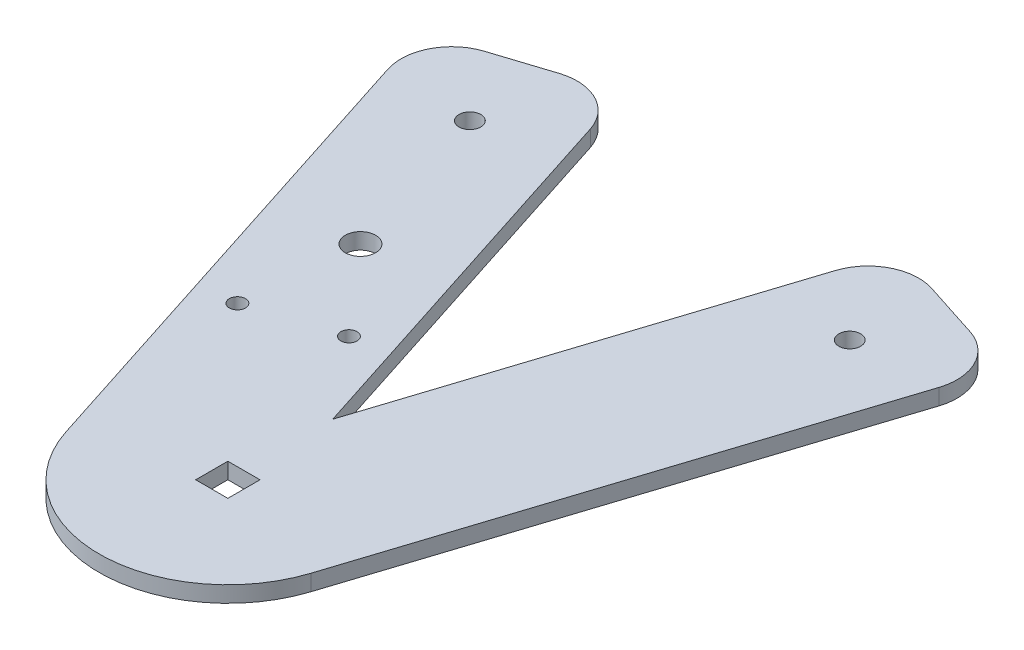
ISO-10303-21;
HEADER;
FILE_DESCRIPTION(('STEP AP214'),'2;1');
FILE_NAME('part.step','',(''),(''),'','','');
FILE_SCHEMA(('AUTOMOTIVE_DESIGN { 1 0 10303 214 1 1 1 1 }'));
ENDSEC;
DATA;
#1=APPLICATION_CONTEXT('core data for automotive mechanical design processes');
#2=APPLICATION_PROTOCOL_DEFINITION('international standard','automotive_design',2000,#1);
#3=PRODUCT_CONTEXT('',#1,'mechanical');
#4=PRODUCT('Part','Part','',(#3));
#5=PRODUCT_RELATED_PRODUCT_CATEGORY('part','',(#4));
#6=PRODUCT_DEFINITION_FORMATION('','',#4);
#7=PRODUCT_DEFINITION_CONTEXT('part definition',#1,'design');
#8=PRODUCT_DEFINITION('design','',#6,#7);
#9=PRODUCT_DEFINITION_SHAPE('','',#8);
#10=(LENGTH_UNIT() NAMED_UNIT(*) SI_UNIT(.MILLI.,.METRE.));
#11=(NAMED_UNIT(*) PLANE_ANGLE_UNIT() SI_UNIT($,.RADIAN.));
#12=(NAMED_UNIT(*) SI_UNIT($,.STERADIAN.) SOLID_ANGLE_UNIT());
#13=UNCERTAINTY_MEASURE_WITH_UNIT(LENGTH_MEASURE(1.E-05),#10,'distance_accuracy_value','');
#14=(GEOMETRIC_REPRESENTATION_CONTEXT(3) GLOBAL_UNCERTAINTY_ASSIGNED_CONTEXT((#13)) GLOBAL_UNIT_ASSIGNED_CONTEXT((#10,
#11,#12)) REPRESENTATION_CONTEXT('',''));
#15=CARTESIAN_POINT('',(0.,0.,0.));
#16=DIRECTION('',(0.,0.,1.));
#17=DIRECTION('',(1.,0.,0.));
#18=AXIS2_PLACEMENT_3D('',#15,#16,#17);
#19=CARTESIAN_POINT('',(0.,3.175,0.));
#20=DIRECTION('',(0.,-1.,0.));
#21=DIRECTION('',(0.,0.,-1.));
#22=AXIS2_PLACEMENT_3D('',#19,#20,#21);
#23=PLANE('',#22);
#24=CARTESIAN_POINT('',(-37.5,3.175,-85.2955486822144));
#25=DIRECTION('',(0.,1.,0.));
#26=DIRECTION('',(0.,0.,1.));
#27=AXIS2_PLACEMENT_3D('',#24,#25,#26);
#28=CIRCLE('',#27,2.15);
#29=CARTESIAN_POINT('',(-37.5,3.175,-83.1455486822144));
#30=VERTEX_POINT('',#29);
#31=EDGE_CURVE('E193',#30,#30,#28,.T.);
#32=ORIENTED_EDGE('',*,*,#31,.F.);
#33=EDGE_LOOP('',(#32));
#34=FACE_BOUND('',#33,.T.);
#35=CARTESIAN_POINT('',(37.5,3.175,-85.2955486822144));
#36=DIRECTION('',(0.,1.,0.));
#37=DIRECTION('',(0.,0.,1.));
#38=AXIS2_PLACEMENT_3D('',#35,#36,#37);
#39=CIRCLE('',#38,2.15);
#40=CARTESIAN_POINT('',(37.5,3.175,-83.1455486822144));
#41=VERTEX_POINT('',#40);
#42=EDGE_CURVE('E199',#41,#41,#39,.T.);
#43=ORIENTED_EDGE('',*,*,#42,.F.);
#44=EDGE_LOOP('',(#43));
#45=FACE_BOUND('',#44,.T.);
#46=DIRECTION('',(0.306777931665619,0.,-0.951781120133702));
#47=VECTOR('',#46,1.);
#48=CARTESIAN_POINT('',(24.175240451396,3.175,7.79215946430672));
#49=LINE('',#48,#47);
#50=CARTESIAN_POINT('',(24.175240451396,3.175,7.79215946430672));
#51=VERTEX_POINT('',#50);
#52=CARTESIAN_POINT('',(54.411845630658,3.175,-86.0171630978082));
#53=VERTEX_POINT('',#52);
#54=EDGE_CURVE('E213',#51,#53,#49,.T.);
#55=ORIENTED_EDGE('',*,*,#54,.T.);
#56=CARTESIAN_POINT('',(44.894034429321,3.175,-89.0849424144644));
#57=DIRECTION('',(0.,-1.,0.));
#58=DIRECTION('',(0.,0.,-1.));
#59=AXIS2_PLACEMENT_3D('',#56,#57,#58);
#60=CIRCLE('',#59,10.);
#61=CARTESIAN_POINT('',(47.9618137459772,3.175,-98.6027536158014));
#62=VERTEX_POINT('',#61);
#63=EDGE_CURVE('E266',#53,#62,#60,.F.);
#64=ORIENTED_EDGE('',*,*,#63,.T.);
#65=DIRECTION('',(-0.951781120133702,0.,-0.306777931665619));
#66=VECTOR('',#65,1.);
#67=CARTESIAN_POINT('',(27.2605743830692,3.175,-105.275173629529));
#68=LINE('',#67,#66);
#69=CARTESIAN_POINT('',(36.7783855844062,3.175,-102.207394312872));
#70=VERTEX_POINT('',#69);
#71=EDGE_CURVE('E216',#62,#70,#68,.T.);
#72=ORIENTED_EDGE('',*,*,#71,.T.);
#73=CARTESIAN_POINT('',(33.71060626775,3.175,-92.6895831115354));
#74=DIRECTION('',(0.,-1.,0.));
#75=DIRECTION('',(0.,0.,-1.));
#76=AXIS2_PLACEMENT_3D('',#73,#74,#75);
#77=CIRCLE('',#76,10.);
#78=CARTESIAN_POINT('',(24.192795066413,3.175,-95.7573624281916));
#79=VERTEX_POINT('',#78);
#80=EDGE_CURVE('E61',#70,#79,#77,.F.);
#81=ORIENTED_EDGE('',*,*,#80,.T.);
#82=DIRECTION('',(-0.306777931665619,0.,0.951781120133702));
#83=VECTOR('',#82,1.);
#84=CARTESIAN_POINT('',(0.,3.175,-20.6990117102731));
#85=LINE('',#84,#83);
#86=CARTESIAN_POINT('',(0.,3.175,-20.6990117102731));
#87=VERTEX_POINT('',#86);
#88=EDGE_CURVE('E218',#79,#87,#85,.T.);
#89=ORIENTED_EDGE('',*,*,#88,.T.);
#90=DIRECTION('',(-0.306777931665619,0.,-0.951781120133702));
#91=VECTOR('',#90,1.);
#92=CARTESIAN_POINT('',(-27.2605743830692,3.175,-105.275173629529));
#93=LINE('',#92,#91);
#94=CARTESIAN_POINT('',(-24.192795066413,3.175,-95.7573624281916));
#95=VERTEX_POINT('',#94);
#96=EDGE_CURVE('E220',#87,#95,#93,.T.);
#97=ORIENTED_EDGE('',*,*,#96,.T.);
#98=CARTESIAN_POINT('',(-33.71060626775,3.175,-92.6895831115354));
#99=DIRECTION('',(0.,-1.,0.));
#100=DIRECTION('',(0.,0.,-1.));
#101=AXIS2_PLACEMENT_3D('',#98,#99,#100);
#102=CIRCLE('',#101,10.);
#103=CARTESIAN_POINT('',(-36.7783855844062,3.175,-102.207394312872));
#104=VERTEX_POINT('',#103);
#105=EDGE_CURVE('E263',#95,#104,#102,.F.);
#106=ORIENTED_EDGE('',*,*,#105,.T.);
#107=DIRECTION('',(-0.951781120133702,0.,0.306777931665618));
#108=VECTOR('',#107,1.);
#109=CARTESIAN_POINT('',(-57.4796249473142,3.175,-95.5349742991452));
#110=LINE('',#109,#108);
#111=CARTESIAN_POINT('',(-47.9618137459772,3.175,-98.6027536158014));
#112=VERTEX_POINT('',#111);
#113=EDGE_CURVE('E205',#104,#112,#110,.T.);
#114=ORIENTED_EDGE('',*,*,#113,.T.);
#115=CARTESIAN_POINT('',(-44.894034429321,3.175,-89.0849424144644));
#116=DIRECTION('',(0.,-1.,0.));
#117=DIRECTION('',(0.,0.,-1.));
#118=AXIS2_PLACEMENT_3D('',#115,#116,#117);
#119=CIRCLE('',#118,10.);
#120=CARTESIAN_POINT('',(-54.411845630658,3.175,-86.0171630978082));
#121=VERTEX_POINT('',#120);
#122=EDGE_CURVE('E261',#112,#121,#119,.F.);
#123=ORIENTED_EDGE('',*,*,#122,.T.);
#124=DIRECTION('',(0.306777931665619,0.,0.951781120133702));
#125=VECTOR('',#124,1.);
#126=CARTESIAN_POINT('',(-57.4796249473142,3.175,-95.5349742991452));
#127=LINE('',#126,#125);
#128=CARTESIAN_POINT('',(-24.175240451396,3.175,7.79215946430672));
#129=VERTEX_POINT('',#128);
#130=EDGE_CURVE('E208',#121,#129,#127,.T.);
#131=ORIENTED_EDGE('',*,*,#130,.T.);
#132=CARTESIAN_POINT('',(0.,3.175,0.));
#133=DIRECTION('',(0.,1.,0.));
#134=DIRECTION('',(0.,0.,-1.));
#135=AXIS2_PLACEMENT_3D('',#132,#133,#134);
#136=CIRCLE('',#135,25.4);
#137=EDGE_CURVE('E211',#129,#51,#136,.T.);
#138=ORIENTED_EDGE('',*,*,#137,.T.);
#139=EDGE_LOOP('',(#55,#64,#72,#81,#89,#97,#106,#114,#123,#131,#138));
#140=FACE_BOUND('',#139,.T.);
#141=DIRECTION('',(0.,0.,-1.));
#142=VECTOR('',#141,1.);
#143=CARTESIAN_POINT('',(3.175,3.175,3.175));
#144=LINE('',#143,#142);
#145=CARTESIAN_POINT('',(3.175,3.175,3.175));
#146=VERTEX_POINT('',#145);
#147=CARTESIAN_POINT('',(3.175,3.175,-3.175));
#148=VERTEX_POINT('',#147);
#149=EDGE_CURVE('E149',#146,#148,#144,.T.);
#150=ORIENTED_EDGE('',*,*,#149,.F.);
#151=DIRECTION('',(1.,0.,0.));
#152=VECTOR('',#151,1.);
#153=CARTESIAN_POINT('',(-3.175,3.175,3.175));
#154=LINE('',#153,#152);
#155=CARTESIAN_POINT('',(-3.175,3.175,3.175));
#156=VERTEX_POINT('',#155);
#157=EDGE_CURVE('E175',#156,#146,#154,.T.);
#158=ORIENTED_EDGE('',*,*,#157,.F.);
#159=DIRECTION('',(0.,0.,1.));
#160=VECTOR('',#159,1.);
#161=CARTESIAN_POINT('',(-3.175,3.175,3.175));
#162=LINE('',#161,#160);
#163=CARTESIAN_POINT('',(-3.175,3.175,-3.175));
#164=VERTEX_POINT('',#163);
#165=EDGE_CURVE('E173',#164,#156,#162,.T.);
#166=ORIENTED_EDGE('',*,*,#165,.F.);
#167=DIRECTION('',(-1.,0.,0.));
#168=VECTOR('',#167,1.);
#169=CARTESIAN_POINT('',(-3.175,3.175,-3.175));
#170=LINE('',#169,#168);
#171=EDGE_CURVE('E159',#148,#164,#170,.T.);
#172=ORIENTED_EDGE('',*,*,#171,.F.);
#173=EDGE_LOOP('',(#150,#158,#166,#172));
#174=FACE_BOUND('',#173,.T.);
#175=CARTESIAN_POINT('',(-27.2229392892018,3.175,-53.4108811577354));
#176=DIRECTION('',(0.,1.,0.));
#177=DIRECTION('',(0.,0.,1.));
#178=AXIS2_PLACEMENT_3D('',#175,#176,#177);
#179=CIRCLE('',#178,3.);
#180=CARTESIAN_POINT('',(-27.2229392892018,3.175,-50.4108811577354));
#181=VERTEX_POINT('',#180);
#182=EDGE_CURVE('E182',#181,#181,#179,.T.);
#183=ORIENTED_EDGE('',*,*,#182,.F.);
#184=EDGE_LOOP('',(#183));
#185=FACE_BOUND('',#184,.T.);
#186=CARTESIAN_POINT('',(-12.5752290957201,3.175,-36.4884969850553));
#187=DIRECTION('',(0.,1.,0.));
#188=DIRECTION('',(0.,0.,1.));
#189=AXIS2_PLACEMENT_3D('',#186,#187,#188);
#190=CIRCLE('',#189,1.6);
#191=CARTESIAN_POINT('',(-12.5752290957201,3.175,-34.8884969850553));
#192=VERTEX_POINT('',#191);
#193=EDGE_CURVE('E416',#192,#192,#190,.T.);
#194=ORIENTED_EDGE('',*,*,#193,.F.);
#195=EDGE_LOOP('',(#194));
#196=FACE_BOUND('',#195,.T.);
#197=CARTESIAN_POINT('',(-29.2313986980599,3.175,-31.1198831809069));
#198=DIRECTION('',(0.,1.,0.));
#199=DIRECTION('',(0.,0.,1.));
#200=AXIS2_PLACEMENT_3D('',#197,#198,#199);
#201=CIRCLE('',#200,1.6);
#202=CARTESIAN_POINT('',(-29.2313986980599,3.175,-29.5198831809069));
#203=VERTEX_POINT('',#202);
#204=EDGE_CURVE('E411',#203,#203,#201,.T.);
#205=ORIENTED_EDGE('',*,*,#204,.F.);
#206=EDGE_LOOP('',(#205));
#207=FACE_BOUND('',#206,.T.);
#208=ADVANCED_FACE('F39',(#34,#45,#140,#174,#185,#196,#207),#23,.F.);
#209=CARTESIAN_POINT('',(0.,0.,0.));
#210=DIRECTION('',(0.,-1.,0.));
#211=DIRECTION('',(0.,0.,-1.));
#212=AXIS2_PLACEMENT_3D('',#209,#210,#211);
#213=PLANE('',#212);
#214=CARTESIAN_POINT('',(-12.5752290957201,0.,-36.4884969850553));
#215=DIRECTION('',(0.,1.,0.));
#216=DIRECTION('',(0.,0.,1.));
#217=AXIS2_PLACEMENT_3D('',#214,#215,#216);
#218=CIRCLE('',#217,1.6);
#219=CARTESIAN_POINT('',(-12.5752290957201,0.,-34.8884969850553));
#220=VERTEX_POINT('',#219);
#221=EDGE_CURVE('E413',#220,#220,#218,.T.);
#222=ORIENTED_EDGE('',*,*,#221,.T.);
#223=EDGE_LOOP('',(#222));
#224=FACE_BOUND('',#223,.T.);
#225=DIRECTION('',(1.,0.,0.));
#226=VECTOR('',#225,1.);
#227=CARTESIAN_POINT('',(-3.175,0.,3.175));
#228=LINE('',#227,#226);
#229=CARTESIAN_POINT('',(-3.175,0.,3.175));
#230=VERTEX_POINT('',#229);
#231=CARTESIAN_POINT('',(3.175,0.,3.175));
#232=VERTEX_POINT('',#231);
#233=EDGE_CURVE('E160',#230,#232,#228,.T.);
#234=ORIENTED_EDGE('',*,*,#233,.T.);
#235=DIRECTION('',(0.,0.,-1.));
#236=VECTOR('',#235,1.);
#237=CARTESIAN_POINT('',(3.175,0.,3.175));
#238=LINE('',#237,#236);
#239=CARTESIAN_POINT('',(3.175,0.,-3.175));
#240=VERTEX_POINT('',#239);
#241=EDGE_CURVE('E180',#232,#240,#238,.T.);
#242=ORIENTED_EDGE('',*,*,#241,.T.);
#243=DIRECTION('',(-1.,0.,0.));
#244=VECTOR('',#243,1.);
#245=CARTESIAN_POINT('',(-3.175,0.,-3.175));
#246=LINE('',#245,#244);
#247=CARTESIAN_POINT('',(-3.175,0.,-3.175));
#248=VERTEX_POINT('',#247);
#249=EDGE_CURVE('E166',#240,#248,#246,.T.);
#250=ORIENTED_EDGE('',*,*,#249,.T.);
#251=DIRECTION('',(0.,0.,1.));
#252=VECTOR('',#251,1.);
#253=CARTESIAN_POINT('',(-3.175,0.,3.175));
#254=LINE('',#253,#252);
#255=EDGE_CURVE('E184',#248,#230,#254,.T.);
#256=ORIENTED_EDGE('',*,*,#255,.T.);
#257=EDGE_LOOP('',(#234,#242,#250,#256));
#258=FACE_BOUND('',#257,.T.);
#259=CARTESIAN_POINT('',(-37.5,0.,-85.2955486822144));
#260=DIRECTION('',(0.,1.,0.));
#261=DIRECTION('',(0.,0.,1.));
#262=AXIS2_PLACEMENT_3D('',#259,#260,#261);
#263=CIRCLE('',#262,2.15);
#264=CARTESIAN_POINT('',(-37.5,0.,-83.1455486822144));
#265=VERTEX_POINT('',#264);
#266=EDGE_CURVE('E167',#265,#265,#263,.T.);
#267=ORIENTED_EDGE('',*,*,#266,.T.);
#268=EDGE_LOOP('',(#267));
#269=FACE_BOUND('',#268,.T.);
#270=DIRECTION('',(-0.951781120133702,0.,-0.306777931665619));
#271=VECTOR('',#270,1.);
#272=CARTESIAN_POINT('',(27.2605743830692,0.,-105.275173629529));
#273=LINE('',#272,#271);
#274=CARTESIAN_POINT('',(47.9618137459772,0.,-98.6027536158014));
#275=VERTEX_POINT('',#274);
#276=CARTESIAN_POINT('',(36.7783855844062,0.,-102.207394312872));
#277=VERTEX_POINT('',#276);
#278=EDGE_CURVE('E232',#275,#277,#273,.T.);
#279=ORIENTED_EDGE('',*,*,#278,.F.);
#280=CARTESIAN_POINT('',(44.894034429321,0.,-89.0849424144644));
#281=DIRECTION('',(0.,-1.,0.));
#282=DIRECTION('',(0.,0.,-1.));
#283=AXIS2_PLACEMENT_3D('',#280,#281,#282);
#284=CIRCLE('',#283,10.);
#285=CARTESIAN_POINT('',(54.411845630658,0.,-86.0171630978082));
#286=VERTEX_POINT('',#285);
#287=EDGE_CURVE('E257',#275,#286,#284,.T.);
#288=ORIENTED_EDGE('',*,*,#287,.T.);
#289=DIRECTION('',(0.306777931665619,0.,-0.951781120133702));
#290=VECTOR('',#289,1.);
#291=CARTESIAN_POINT('',(24.175240451396,0.,7.79215946430672));
#292=LINE('',#291,#290);
#293=CARTESIAN_POINT('',(24.175240451396,0.,7.79215946430672));
#294=VERTEX_POINT('',#293);
#295=EDGE_CURVE('E229',#294,#286,#292,.T.);
#296=ORIENTED_EDGE('',*,*,#295,.F.);
#297=CARTESIAN_POINT('',(0.,0.,0.));
#298=DIRECTION('',(0.,1.,0.));
#299=DIRECTION('',(0.,0.,-1.));
#300=AXIS2_PLACEMENT_3D('',#297,#298,#299);
#301=CIRCLE('',#300,25.4);
#302=CARTESIAN_POINT('',(-24.175240451396,0.,7.79215946430672));
#303=VERTEX_POINT('',#302);
#304=EDGE_CURVE('E227',#303,#294,#301,.T.);
#305=ORIENTED_EDGE('',*,*,#304,.F.);
#306=DIRECTION('',(0.306777931665619,0.,0.951781120133702));
#307=VECTOR('',#306,1.);
#308=CARTESIAN_POINT('',(-57.4796249473142,0.,-95.5349742991452));
#309=LINE('',#308,#307);
#310=CARTESIAN_POINT('',(-54.411845630658,0.,-86.0171630978082));
#311=VERTEX_POINT('',#310);
#312=EDGE_CURVE('E225',#311,#303,#309,.T.);
#313=ORIENTED_EDGE('',*,*,#312,.F.);
#314=CARTESIAN_POINT('',(-44.894034429321,0.,-89.0849424144644));
#315=DIRECTION('',(0.,-1.,0.));
#316=DIRECTION('',(0.,0.,-1.));
#317=AXIS2_PLACEMENT_3D('',#314,#315,#316);
#318=CIRCLE('',#317,10.);
#319=CARTESIAN_POINT('',(-47.9618137459772,0.,-98.6027536158014));
#320=VERTEX_POINT('',#319);
#321=EDGE_CURVE('E251',#311,#320,#318,.T.);
#322=ORIENTED_EDGE('',*,*,#321,.T.);
#323=DIRECTION('',(-0.951781120133702,0.,0.306777931665618));
#324=VECTOR('',#323,1.);
#325=CARTESIAN_POINT('',(-57.4796249473142,0.,-95.5349742991452));
#326=LINE('',#325,#324);
#327=CARTESIAN_POINT('',(-36.7783855844062,0.,-102.207394312872));
#328=VERTEX_POINT('',#327);
#329=EDGE_CURVE('E202',#328,#320,#326,.T.);
#330=ORIENTED_EDGE('',*,*,#329,.F.);
#331=CARTESIAN_POINT('',(-33.71060626775,0.,-92.6895831115354));
#332=DIRECTION('',(0.,-1.,0.));
#333=DIRECTION('',(0.,0.,-1.));
#334=AXIS2_PLACEMENT_3D('',#331,#332,#333);
#335=CIRCLE('',#334,10.);
#336=CARTESIAN_POINT('',(-24.192795066413,0.,-95.7573624281916));
#337=VERTEX_POINT('',#336);
#338=EDGE_CURVE('E253',#328,#337,#335,.T.);
#339=ORIENTED_EDGE('',*,*,#338,.T.);
#340=DIRECTION('',(-0.306777931665619,0.,-0.951781120133702));
#341=VECTOR('',#340,1.);
#342=CARTESIAN_POINT('',(-27.2605743830692,0.,-105.275173629529));
#343=LINE('',#342,#341);
#344=CARTESIAN_POINT('',(0.,0.,-20.6990117102731));
#345=VERTEX_POINT('',#344);
#346=EDGE_CURVE('E209',#345,#337,#343,.T.);
#347=ORIENTED_EDGE('',*,*,#346,.F.);
#348=DIRECTION('',(-0.306777931665619,0.,0.951781120133702));
#349=VECTOR('',#348,1.);
#350=CARTESIAN_POINT('',(0.,0.,-20.6990117102731));
#351=LINE('',#350,#349);
#352=CARTESIAN_POINT('',(24.192795066413,0.,-95.7573624281916));
#353=VERTEX_POINT('',#352);
#354=EDGE_CURVE('E235',#353,#345,#351,.T.);
#355=ORIENTED_EDGE('',*,*,#354,.F.);
#356=CARTESIAN_POINT('',(33.71060626775,0.,-92.6895831115354));
#357=DIRECTION('',(0.,-1.,0.));
#358=DIRECTION('',(0.,0.,-1.));
#359=AXIS2_PLACEMENT_3D('',#356,#357,#358);
#360=CIRCLE('',#359,10.);
#361=EDGE_CURVE('E255',#353,#277,#360,.T.);
#362=ORIENTED_EDGE('',*,*,#361,.T.);
#363=EDGE_LOOP('',(#279,#288,#296,#305,#313,#322,#330,#339,#347,#355,#362));
#364=FACE_BOUND('',#363,.T.);
#365=CARTESIAN_POINT('',(37.5,0.,-85.2955486822144));
#366=DIRECTION('',(0.,1.,0.));
#367=DIRECTION('',(0.,0.,1.));
#368=AXIS2_PLACEMENT_3D('',#365,#366,#367);
#369=CIRCLE('',#368,2.15);
#370=CARTESIAN_POINT('',(37.5,0.,-83.1455486822144));
#371=VERTEX_POINT('',#370);
#372=EDGE_CURVE('E196',#371,#371,#369,.T.);
#373=ORIENTED_EDGE('',*,*,#372,.T.);
#374=EDGE_LOOP('',(#373));
#375=FACE_BOUND('',#374,.T.);
#376=CARTESIAN_POINT('',(-27.2229392892018,0.,-53.4108811577354));
#377=DIRECTION('',(0.,1.,0.));
#378=DIRECTION('',(0.,0.,1.));
#379=AXIS2_PLACEMENT_3D('',#376,#377,#378);
#380=CIRCLE('',#379,3.);
#381=CARTESIAN_POINT('',(-27.2229392892018,0.,-50.4108811577354));
#382=VERTEX_POINT('',#381);
#383=EDGE_CURVE('E407',#382,#382,#380,.T.);
#384=ORIENTED_EDGE('',*,*,#383,.T.);
#385=EDGE_LOOP('',(#384));
#386=FACE_BOUND('',#385,.T.);
#387=CARTESIAN_POINT('',(-29.2313986980599,0.,-31.1198831809069));
#388=DIRECTION('',(0.,1.,0.));
#389=DIRECTION('',(0.,0.,1.));
#390=AXIS2_PLACEMENT_3D('',#387,#388,#389);
#391=CIRCLE('',#390,1.6);
#392=CARTESIAN_POINT('',(-29.2313986980599,0.,-29.5198831809069));
#393=VERTEX_POINT('',#392);
#394=EDGE_CURVE('E410',#393,#393,#391,.T.);
#395=ORIENTED_EDGE('',*,*,#394,.T.);
#396=EDGE_LOOP('',(#395));
#397=FACE_BOUND('',#396,.T.);
#398=ADVANCED_FACE('F285',(#224,#258,#269,#364,#375,#386,#397),#213,.T.);
#399=CARTESIAN_POINT('',(-57.4796249473142,3.175,-95.5349742991452));
#400=DIRECTION('',(0.306777931665618,0.,0.951781120133702));
#401=DIRECTION('',(0.951781120133702,0.,-0.306777931665618));
#402=AXIS2_PLACEMENT_3D('',#399,#400,#401);
#403=PLANE('',#402);
#404=ORIENTED_EDGE('',*,*,#113,.F.);
#405=DIRECTION('',(0.,-1.,0.));
#406=VECTOR('',#405,1.);
#407=CARTESIAN_POINT('',(-36.7783855844062,3.175,-102.207394312872));
#408=LINE('',#407,#406);
#409=EDGE_CURVE('E273',#104,#328,#408,.T.);
#410=ORIENTED_EDGE('',*,*,#409,.T.);
#411=ORIENTED_EDGE('',*,*,#329,.T.);
#412=DIRECTION('',(0.,-1.,0.));
#413=VECTOR('',#412,1.);
#414=CARTESIAN_POINT('',(-47.9618137459772,3.175,-98.6027536158014));
#415=LINE('',#414,#413);
#416=EDGE_CURVE('E271',#320,#112,#415,.F.);
#417=ORIENTED_EDGE('',*,*,#416,.T.);
#418=EDGE_LOOP('',(#404,#410,#411,#417));
#419=FACE_BOUND('',#418,.T.);
#420=ADVANCED_FACE('F279',(#419),#403,.F.);
#421=CARTESIAN_POINT('',(-57.4796249473142,3.175,-95.5349742991452));
#422=DIRECTION('',(0.951781120133702,0.,-0.306777931665619));
#423=DIRECTION('',(-0.306777931665619,0.,-0.951781120133702));
#424=AXIS2_PLACEMENT_3D('',#421,#422,#423);
#425=PLANE('',#424);
#426=ORIENTED_EDGE('',*,*,#130,.F.);
#427=DIRECTION('',(0.,-1.,0.));
#428=VECTOR('',#427,1.);
#429=CARTESIAN_POINT('',(-54.411845630658,3.175,-86.0171630978082));
#430=LINE('',#429,#428);
#431=EDGE_CURVE('E11',#121,#311,#430,.T.);
#432=ORIENTED_EDGE('',*,*,#431,.T.);
#433=ORIENTED_EDGE('',*,*,#312,.T.);
#434=DIRECTION('',(0.,-1.,0.));
#435=VECTOR('',#434,1.);
#436=CARTESIAN_POINT('',(-24.175240451396,3.175,7.79215946430672));
#437=LINE('',#436,#435);
#438=EDGE_CURVE('E243',#129,#303,#437,.T.);
#439=ORIENTED_EDGE('',*,*,#438,.F.);
#440=EDGE_LOOP('',(#426,#432,#433,#439));
#441=FACE_BOUND('',#440,.T.);
#442=ADVANCED_FACE('F295',(#441),#425,.F.);
#443=CARTESIAN_POINT('',(0.,3.175,0.));
#444=DIRECTION('',(0.,-1.,0.));
#445=DIRECTION('',(0.,0.,-1.));
#446=AXIS2_PLACEMENT_3D('',#443,#444,#445);
#447=CYLINDRICAL_SURFACE('',#446,25.4);
#448=ORIENTED_EDGE('',*,*,#304,.T.);
#449=DIRECTION('',(0.,-1.,0.));
#450=VECTOR('',#449,1.);
#451=CARTESIAN_POINT('',(24.175240451396,3.175,7.79215946430672));
#452=LINE('',#451,#450);
#453=EDGE_CURVE('E240',#51,#294,#452,.T.);
#454=ORIENTED_EDGE('',*,*,#453,.F.);
#455=ORIENTED_EDGE('',*,*,#137,.F.);
#456=ORIENTED_EDGE('',*,*,#438,.T.);
#457=EDGE_LOOP('',(#448,#454,#455,#456));
#458=FACE_BOUND('',#457,.T.);
#459=ADVANCED_FACE('F338',(#458),#447,.T.);
#460=CARTESIAN_POINT('',(24.175240451396,3.175,7.79215946430672));
#461=DIRECTION('',(-0.951781120133702,0.,-0.306777931665619));
#462=DIRECTION('',(-0.306777931665619,0.,0.951781120133702));
#463=AXIS2_PLACEMENT_3D('',#460,#461,#462);
#464=PLANE('',#463);
#465=ORIENTED_EDGE('',*,*,#295,.T.);
#466=DIRECTION('',(0.,-1.,0.));
#467=VECTOR('',#466,1.);
#468=CARTESIAN_POINT('',(54.411845630658,3.175,-86.0171630978082));
#469=LINE('',#468,#467);
#470=EDGE_CURVE('E259',#286,#53,#469,.F.);
#471=ORIENTED_EDGE('',*,*,#470,.T.);
#472=ORIENTED_EDGE('',*,*,#54,.F.);
#473=ORIENTED_EDGE('',*,*,#453,.T.);
#474=EDGE_LOOP('',(#465,#471,#472,#473));
#475=FACE_BOUND('',#474,.T.);
#476=ADVANCED_FACE('F334',(#475),#464,.F.);
#477=CARTESIAN_POINT('',(27.2605743830692,3.175,-105.275173629529));
#478=DIRECTION('',(-0.306777931665619,0.,0.951781120133702));
#479=DIRECTION('',(0.951781120133702,0.,0.306777931665619));
#480=AXIS2_PLACEMENT_3D('',#477,#478,#479);
#481=PLANE('',#480);
#482=ORIENTED_EDGE('',*,*,#71,.F.);
#483=DIRECTION('',(0.,-1.,0.));
#484=VECTOR('',#483,1.);
#485=CARTESIAN_POINT('',(47.9618137459772,3.175,-98.6027536158014));
#486=LINE('',#485,#484);
#487=EDGE_CURVE('E248',#62,#275,#486,.T.);
#488=ORIENTED_EDGE('',*,*,#487,.T.);
#489=ORIENTED_EDGE('',*,*,#278,.T.);
#490=DIRECTION('',(0.,-1.,0.));
#491=VECTOR('',#490,1.);
#492=CARTESIAN_POINT('',(36.7783855844062,3.175,-102.207394312872));
#493=LINE('',#492,#491);
#494=EDGE_CURVE('E246',#277,#70,#493,.F.);
#495=ORIENTED_EDGE('',*,*,#494,.T.);
#496=EDGE_LOOP('',(#482,#488,#489,#495));
#497=FACE_BOUND('',#496,.T.);
#498=ADVANCED_FACE('F330',(#497),#481,.F.);
#499=CARTESIAN_POINT('',(0.,3.175,-20.6990117102731));
#500=DIRECTION('',(0.951781120133702,0.,0.306777931665619));
#501=DIRECTION('',(0.306777931665619,0.,-0.951781120133702));
#502=AXIS2_PLACEMENT_3D('',#499,#500,#501);
#503=PLANE('',#502);
#504=ORIENTED_EDGE('',*,*,#88,.F.);
#505=DIRECTION('',(0.,-1.,0.));
#506=VECTOR('',#505,1.);
#507=CARTESIAN_POINT('',(24.192795066413,3.175,-95.7573624281916));
#508=LINE('',#507,#506);
#509=EDGE_CURVE('E268',#79,#353,#508,.T.);
#510=ORIENTED_EDGE('',*,*,#509,.T.);
#511=ORIENTED_EDGE('',*,*,#354,.T.);
#512=DIRECTION('',(0.,-1.,0.));
#513=VECTOR('',#512,1.);
#514=CARTESIAN_POINT('',(0.,3.175,-20.6990117102731));
#515=LINE('',#514,#513);
#516=EDGE_CURVE('E222',#87,#345,#515,.T.);
#517=ORIENTED_EDGE('',*,*,#516,.F.);
#518=EDGE_LOOP('',(#504,#510,#511,#517));
#519=FACE_BOUND('',#518,.T.);
#520=ADVANCED_FACE('F327',(#519),#503,.F.);
#521=CARTESIAN_POINT('',(-27.2605743830692,3.175,-105.275173629529));
#522=DIRECTION('',(-0.951781120133702,0.,0.306777931665619));
#523=DIRECTION('',(0.306777931665619,0.,0.951781120133702));
#524=AXIS2_PLACEMENT_3D('',#521,#522,#523);
#525=PLANE('',#524);
#526=ORIENTED_EDGE('',*,*,#346,.T.);
#527=DIRECTION('',(0.,-1.,0.));
#528=VECTOR('',#527,1.);
#529=CARTESIAN_POINT('',(-24.192795066413,3.175,-95.7573624281916));
#530=LINE('',#529,#528);
#531=EDGE_CURVE('E47',#337,#95,#530,.F.);
#532=ORIENTED_EDGE('',*,*,#531,.T.);
#533=ORIENTED_EDGE('',*,*,#96,.F.);
#534=ORIENTED_EDGE('',*,*,#516,.T.);
#535=EDGE_LOOP('',(#526,#532,#533,#534));
#536=FACE_BOUND('',#535,.T.);
#537=ADVANCED_FACE('F324',(#536),#525,.F.);
#538=CARTESIAN_POINT('',(37.5,3.175,-85.2955486822144));
#539=DIRECTION('',(0.,-1.,0.));
#540=DIRECTION('',(0.,0.,-1.));
#541=AXIS2_PLACEMENT_3D('',#538,#539,#540);
#542=CYLINDRICAL_SURFACE('',#541,2.15);
#543=ORIENTED_EDGE('',*,*,#42,.T.);
#544=EDGE_LOOP('',(#543));
#545=FACE_BOUND('',#544,.T.);
#546=ORIENTED_EDGE('',*,*,#372,.F.);
#547=EDGE_LOOP('',(#546));
#548=FACE_BOUND('',#547,.T.);
#549=ADVANCED_FACE('F321',(#545,#548),#542,.F.);
#550=CARTESIAN_POINT('',(-37.5,3.175,-85.2955486822144));
#551=DIRECTION('',(0.,-1.,0.));
#552=DIRECTION('',(0.,0.,-1.));
#553=AXIS2_PLACEMENT_3D('',#550,#551,#552);
#554=CYLINDRICAL_SURFACE('',#553,2.15);
#555=ORIENTED_EDGE('',*,*,#31,.T.);
#556=EDGE_LOOP('',(#555));
#557=FACE_BOUND('',#556,.T.);
#558=ORIENTED_EDGE('',*,*,#266,.F.);
#559=EDGE_LOOP('',(#558));
#560=FACE_BOUND('',#559,.T.);
#561=ADVANCED_FACE('F388',(#557,#560),#554,.F.);
#562=CARTESIAN_POINT('',(3.175,3.175,3.175));
#563=DIRECTION('',(-1.,0.,0.));
#564=DIRECTION('',(0.,0.,1.));
#565=AXIS2_PLACEMENT_3D('',#562,#563,#564);
#566=PLANE('',#565);
#567=ORIENTED_EDGE('',*,*,#241,.F.);
#568=DIRECTION('',(0.,-1.,0.));
#569=VECTOR('',#568,1.);
#570=CARTESIAN_POINT('',(3.175,3.175,3.175));
#571=LINE('',#570,#569);
#572=EDGE_CURVE('E155',#146,#232,#571,.T.);
#573=ORIENTED_EDGE('',*,*,#572,.F.);
#574=ORIENTED_EDGE('',*,*,#149,.T.);
#575=DIRECTION('',(0.,-1.,0.));
#576=VECTOR('',#575,1.);
#577=CARTESIAN_POINT('',(3.175,3.175,-3.175));
#578=LINE('',#577,#576);
#579=EDGE_CURVE('E152',#148,#240,#578,.T.);
#580=ORIENTED_EDGE('',*,*,#579,.T.);
#581=EDGE_LOOP('',(#567,#573,#574,#580));
#582=FACE_BOUND('',#581,.T.);
#583=ADVANCED_FACE('F151',(#582),#566,.T.);
#584=CARTESIAN_POINT('',(-3.175,3.175,-3.175));
#585=DIRECTION('',(0.,0.,1.));
#586=DIRECTION('',(1.,0.,0.));
#587=AXIS2_PLACEMENT_3D('',#584,#585,#586);
#588=PLANE('',#587);
#589=ORIENTED_EDGE('',*,*,#249,.F.);
#590=ORIENTED_EDGE('',*,*,#579,.F.);
#591=ORIENTED_EDGE('',*,*,#171,.T.);
#592=DIRECTION('',(0.,-1.,0.));
#593=VECTOR('',#592,1.);
#594=CARTESIAN_POINT('',(-3.175,3.175,-3.175));
#595=LINE('',#594,#593);
#596=EDGE_CURVE('E168',#164,#248,#595,.T.);
#597=ORIENTED_EDGE('',*,*,#596,.T.);
#598=EDGE_LOOP('',(#589,#590,#591,#597));
#599=FACE_BOUND('',#598,.T.);
#600=ADVANCED_FACE('F163',(#599),#588,.T.);
#601=CARTESIAN_POINT('',(-3.175,3.175,3.175));
#602=DIRECTION('',(1.,0.,0.));
#603=DIRECTION('',(0.,0.,-1.));
#604=AXIS2_PLACEMENT_3D('',#601,#602,#603);
#605=PLANE('',#604);
#606=ORIENTED_EDGE('',*,*,#255,.F.);
#607=ORIENTED_EDGE('',*,*,#596,.F.);
#608=ORIENTED_EDGE('',*,*,#165,.T.);
#609=DIRECTION('',(0.,-1.,0.));
#610=VECTOR('',#609,1.);
#611=CARTESIAN_POINT('',(-3.175,3.175,3.175));
#612=LINE('',#611,#610);
#613=EDGE_CURVE('E190',#156,#230,#612,.T.);
#614=ORIENTED_EDGE('',*,*,#613,.T.);
#615=EDGE_LOOP('',(#606,#607,#608,#614));
#616=FACE_BOUND('',#615,.T.);
#617=ADVANCED_FACE('F380',(#616),#605,.T.);
#618=CARTESIAN_POINT('',(-3.175,3.175,3.175));
#619=DIRECTION('',(0.,0.,-1.));
#620=DIRECTION('',(-1.,0.,0.));
#621=AXIS2_PLACEMENT_3D('',#618,#619,#620);
#622=PLANE('',#621);
#623=ORIENTED_EDGE('',*,*,#233,.F.);
#624=ORIENTED_EDGE('',*,*,#613,.F.);
#625=ORIENTED_EDGE('',*,*,#157,.T.);
#626=ORIENTED_EDGE('',*,*,#572,.T.);
#627=EDGE_LOOP('',(#623,#624,#625,#626));
#628=FACE_BOUND('',#627,.T.);
#629=ADVANCED_FACE('F376',(#628),#622,.T.);
#630=CARTESIAN_POINT('',(-27.2229392892018,3.175,-53.4108811577354));
#631=DIRECTION('',(0.,-1.,0.));
#632=DIRECTION('',(0.,0.,-1.));
#633=AXIS2_PLACEMENT_3D('',#630,#631,#632);
#634=CYLINDRICAL_SURFACE('',#633,3.);
#635=ORIENTED_EDGE('',*,*,#182,.T.);
#636=EDGE_LOOP('',(#635));
#637=FACE_BOUND('',#636,.T.);
#638=ORIENTED_EDGE('',*,*,#383,.F.);
#639=EDGE_LOOP('',(#638));
#640=FACE_BOUND('',#639,.T.);
#641=ADVANCED_FACE('F368',(#637,#640),#634,.F.);
#642=CARTESIAN_POINT('',(-12.5752290957201,3.175,-36.4884969850553));
#643=DIRECTION('',(0.,-1.,0.));
#644=DIRECTION('',(0.,0.,-1.));
#645=AXIS2_PLACEMENT_3D('',#642,#643,#644);
#646=CYLINDRICAL_SURFACE('',#645,1.6);
#647=ORIENTED_EDGE('',*,*,#193,.T.);
#648=EDGE_LOOP('',(#647));
#649=FACE_BOUND('',#648,.T.);
#650=ORIENTED_EDGE('',*,*,#221,.F.);
#651=EDGE_LOOP('',(#650));
#652=FACE_BOUND('',#651,.T.);
#653=ADVANCED_FACE('F352',(#649,#652),#646,.F.);
#654=CARTESIAN_POINT('',(-29.2313986980599,3.175,-31.1198831809069));
#655=DIRECTION('',(0.,-1.,0.));
#656=DIRECTION('',(0.,0.,-1.));
#657=AXIS2_PLACEMENT_3D('',#654,#655,#656);
#658=CYLINDRICAL_SURFACE('',#657,1.6);
#659=ORIENTED_EDGE('',*,*,#204,.T.);
#660=EDGE_LOOP('',(#659));
#661=FACE_BOUND('',#660,.T.);
#662=ORIENTED_EDGE('',*,*,#394,.F.);
#663=EDGE_LOOP('',(#662));
#664=FACE_BOUND('',#663,.T.);
#665=ADVANCED_FACE('F348',(#661,#664),#658,.F.);
#666=CARTESIAN_POINT('',(44.894034429321,3.175,-89.0849424144644));
#667=DIRECTION('',(0.,-1.,0.));
#668=DIRECTION('',(0.,0.,-1.));
#669=AXIS2_PLACEMENT_3D('',#666,#667,#668);
#670=CYLINDRICAL_SURFACE('',#669,10.);
#671=ORIENTED_EDGE('',*,*,#63,.F.);
#672=ORIENTED_EDGE('',*,*,#470,.F.);
#673=ORIENTED_EDGE('',*,*,#287,.F.);
#674=ORIENTED_EDGE('',*,*,#487,.F.);
#675=EDGE_LOOP('',(#671,#672,#673,#674));
#676=FACE_BOUND('',#675,.T.);
#677=ADVANCED_FACE('F306',(#676),#670,.T.);
#678=CARTESIAN_POINT('',(33.71060626775,3.175,-92.6895831115354));
#679=DIRECTION('',(0.,-1.,0.));
#680=DIRECTION('',(0.,0.,-1.));
#681=AXIS2_PLACEMENT_3D('',#678,#679,#680);
#682=CYLINDRICAL_SURFACE('',#681,10.);
#683=ORIENTED_EDGE('',*,*,#80,.F.);
#684=ORIENTED_EDGE('',*,*,#494,.F.);
#685=ORIENTED_EDGE('',*,*,#361,.F.);
#686=ORIENTED_EDGE('',*,*,#509,.F.);
#687=EDGE_LOOP('',(#683,#684,#685,#686));
#688=FACE_BOUND('',#687,.T.);
#689=ADVANCED_FACE('F301',(#688),#682,.T.);
#690=CARTESIAN_POINT('',(-33.71060626775,3.175,-92.6895831115354));
#691=DIRECTION('',(0.,-1.,0.));
#692=DIRECTION('',(0.,0.,-1.));
#693=AXIS2_PLACEMENT_3D('',#690,#691,#692);
#694=CYLINDRICAL_SURFACE('',#693,10.);
#695=ORIENTED_EDGE('',*,*,#105,.F.);
#696=ORIENTED_EDGE('',*,*,#531,.F.);
#697=ORIENTED_EDGE('',*,*,#338,.F.);
#698=ORIENTED_EDGE('',*,*,#409,.F.);
#699=EDGE_LOOP('',(#695,#696,#697,#698));
#700=FACE_BOUND('',#699,.T.);
#701=ADVANCED_FACE('F299',(#700),#694,.T.);
#702=CARTESIAN_POINT('',(-44.894034429321,3.175,-89.0849424144644));
#703=DIRECTION('',(0.,-1.,0.));
#704=DIRECTION('',(0.,0.,-1.));
#705=AXIS2_PLACEMENT_3D('',#702,#703,#704);
#706=CYLINDRICAL_SURFACE('',#705,10.);
#707=ORIENTED_EDGE('',*,*,#122,.F.);
#708=ORIENTED_EDGE('',*,*,#416,.F.);
#709=ORIENTED_EDGE('',*,*,#321,.F.);
#710=ORIENTED_EDGE('',*,*,#431,.F.);
#711=EDGE_LOOP('',(#707,#708,#709,#710));
#712=FACE_BOUND('',#711,.T.);
#713=ADVANCED_FACE('F41',(#712),#706,.T.);
#714=CLOSED_SHELL('',(#208,#398,#420,#442,#459,#476,#498,#520,#537,#549,#561,#583,#600,#617,
#629,#641,#653,#665,#677,#689,#701,#713));
#715=MANIFOLD_SOLID_BREP('B2',#714);
#716=ADVANCED_BREP_SHAPE_REPRESENTATION('',(#18,#715),#14);
#717=SHAPE_DEFINITION_REPRESENTATION(#9,#716);
ENDSEC;
END-ISO-10303-21;
